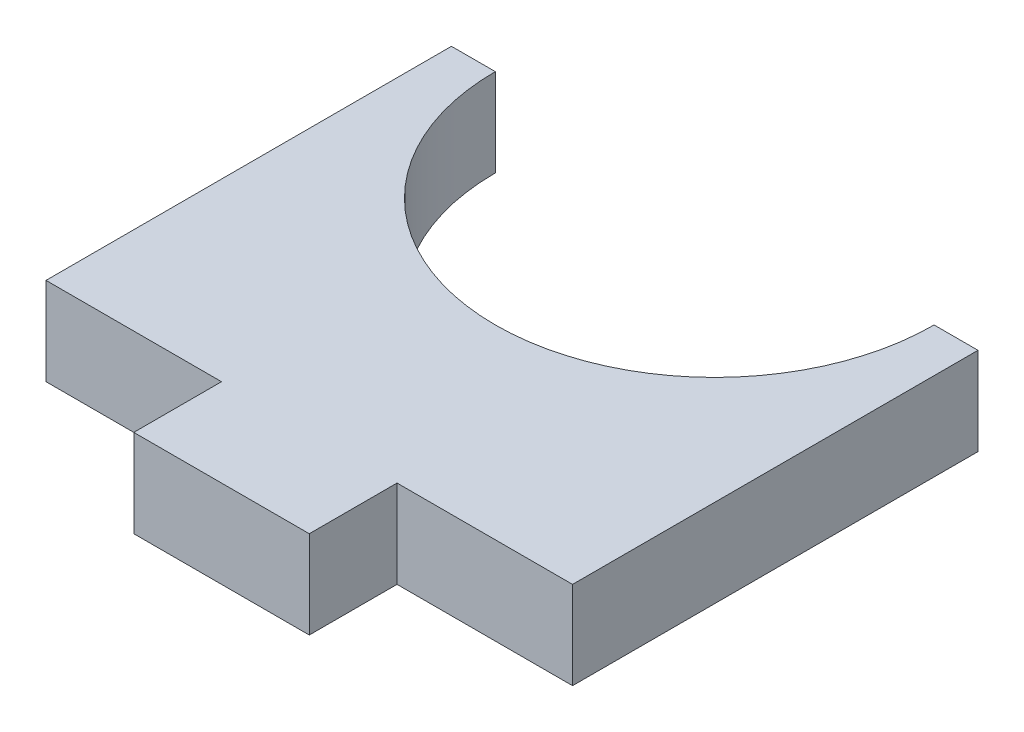
ISO-10303-21;
HEADER;
FILE_DESCRIPTION(('STEP AP214'),'2;1');
FILE_NAME('part.step','',(''),(''),'','','');
FILE_SCHEMA(('AUTOMOTIVE_DESIGN { 1 0 10303 214 1 1 1 1 }'));
ENDSEC;
DATA;
#1=APPLICATION_CONTEXT('core data for automotive mechanical design processes');
#2=APPLICATION_PROTOCOL_DEFINITION('international standard','automotive_design',2000,#1);
#3=PRODUCT_CONTEXT('',#1,'mechanical');
#4=PRODUCT('Part','Part','',(#3));
#5=PRODUCT_RELATED_PRODUCT_CATEGORY('part','',(#4));
#6=PRODUCT_DEFINITION_FORMATION('','',#4);
#7=PRODUCT_DEFINITION_CONTEXT('part definition',#1,'design');
#8=PRODUCT_DEFINITION('design','',#6,#7);
#9=PRODUCT_DEFINITION_SHAPE('','',#8);
#10=(LENGTH_UNIT() NAMED_UNIT(*) SI_UNIT(.MILLI.,.METRE.));
#11=(NAMED_UNIT(*) PLANE_ANGLE_UNIT() SI_UNIT($,.RADIAN.));
#12=(NAMED_UNIT(*) SI_UNIT($,.STERADIAN.) SOLID_ANGLE_UNIT());
#13=UNCERTAINTY_MEASURE_WITH_UNIT(LENGTH_MEASURE(1.E-05),#10,'distance_accuracy_value','');
#14=(GEOMETRIC_REPRESENTATION_CONTEXT(3) GLOBAL_UNCERTAINTY_ASSIGNED_CONTEXT((#13)) GLOBAL_UNIT_ASSIGNED_CONTEXT((#10,
#11,#12)) REPRESENTATION_CONTEXT('',''));
#15=CARTESIAN_POINT('',(0.,0.,0.));
#16=DIRECTION('',(0.,0.,1.));
#17=DIRECTION('',(1.,0.,0.));
#18=AXIS2_PLACEMENT_3D('',#15,#16,#17);
#19=CARTESIAN_POINT('',(0.,5.,11.55));
#20=DIRECTION('',(0.,0.,-1.));
#21=DIRECTION('',(-1.,0.,0.));
#22=AXIS2_PLACEMENT_3D('',#19,#20,#21);
#23=PLANE('',#22);
#24=DIRECTION('',(0.,1.,0.));
#25=VECTOR('',#24,1.);
#26=CARTESIAN_POINT('',(5.,0.,11.55));
#27=LINE('',#26,#25);
#28=CARTESIAN_POINT('',(5.,0.,11.55));
#29=VERTEX_POINT('',#28);
#30=CARTESIAN_POINT('',(5.,5.,11.55));
#31=VERTEX_POINT('',#30);
#32=EDGE_CURVE('E140',#29,#31,#27,.T.);
#33=ORIENTED_EDGE('',*,*,#32,.F.);
#34=DIRECTION('',(1.,0.,0.));
#35=VECTOR('',#34,1.);
#36=CARTESIAN_POINT('',(0.,0.,11.55));
#37=LINE('',#36,#35);
#38=CARTESIAN_POINT('',(15.,0.,11.55));
#39=VERTEX_POINT('',#38);
#40=EDGE_CURVE('E116',#29,#39,#37,.T.);
#41=ORIENTED_EDGE('',*,*,#40,.T.);
#42=DIRECTION('',(0.,-1.,0.));
#43=VECTOR('',#42,1.);
#44=CARTESIAN_POINT('',(15.,5.,11.55));
#45=LINE('',#44,#43);
#46=CARTESIAN_POINT('',(15.,5.,11.55));
#47=VERTEX_POINT('',#46);
#48=EDGE_CURVE('E95',#47,#39,#45,.T.);
#49=ORIENTED_EDGE('',*,*,#48,.F.);
#50=DIRECTION('',(1.,0.,0.));
#51=VECTOR('',#50,1.);
#52=CARTESIAN_POINT('',(0.,5.,11.55));
#53=LINE('',#52,#51);
#54=EDGE_CURVE('E64',#31,#47,#53,.T.);
#55=ORIENTED_EDGE('',*,*,#54,.F.);
#56=EDGE_LOOP('',(#33,#41,#49,#55));
#57=FACE_BOUND('',#56,.T.);
#58=ADVANCED_FACE('F40',(#57),#23,.F.);
#59=CARTESIAN_POINT('',(-15.,5.,0.));
#60=DIRECTION('',(-1.,0.,0.));
#61=DIRECTION('',(0.,0.,1.));
#62=AXIS2_PLACEMENT_3D('',#59,#60,#61);
#63=PLANE('',#62);
#64=DIRECTION('',(0.,0.,-1.));
#65=VECTOR('',#64,1.);
#66=CARTESIAN_POINT('',(-15.,0.,0.));
#67=LINE('',#66,#65);
#68=CARTESIAN_POINT('',(-15.,0.,11.55));
#69=VERTEX_POINT('',#68);
#70=CARTESIAN_POINT('',(-15.,0.,-11.55));
#71=VERTEX_POINT('',#70);
#72=EDGE_CURVE('E128',#69,#71,#67,.T.);
#73=ORIENTED_EDGE('',*,*,#72,.F.);
#74=DIRECTION('',(0.,-1.,0.));
#75=VECTOR('',#74,1.);
#76=CARTESIAN_POINT('',(-15.,5.,11.55));
#77=LINE('',#76,#75);
#78=CARTESIAN_POINT('',(-15.,5.,11.55));
#79=VERTEX_POINT('',#78);
#80=EDGE_CURVE('E121',#79,#69,#77,.T.);
#81=ORIENTED_EDGE('',*,*,#80,.F.);
#82=DIRECTION('',(0.,0.,-1.));
#83=VECTOR('',#82,1.);
#84=CARTESIAN_POINT('',(-15.,5.,0.));
#85=LINE('',#84,#83);
#86=CARTESIAN_POINT('',(-15.,5.,-11.55));
#87=VERTEX_POINT('',#86);
#88=EDGE_CURVE('E110',#79,#87,#85,.T.);
#89=ORIENTED_EDGE('',*,*,#88,.T.);
#90=DIRECTION('',(0.,-1.,0.));
#91=VECTOR('',#90,1.);
#92=CARTESIAN_POINT('',(-15.,5.,-11.55));
#93=LINE('',#92,#91);
#94=EDGE_CURVE('E106',#87,#71,#93,.T.);
#95=ORIENTED_EDGE('',*,*,#94,.T.);
#96=EDGE_LOOP('',(#73,#81,#89,#95));
#97=FACE_BOUND('',#96,.T.);
#98=ADVANCED_FACE('F42',(#97),#63,.T.);
#99=CARTESIAN_POINT('',(-5.,0.,11.55));
#100=VERTEX_POINT('',#99);
#101=EDGE_CURVE('E111',#69,#100,#37,.T.);
#102=ORIENTED_EDGE('',*,*,#101,.T.);
#103=DIRECTION('',(0.,1.,0.));
#104=VECTOR('',#103,1.);
#105=CARTESIAN_POINT('',(-5.,0.,11.55));
#106=LINE('',#105,#104);
#107=CARTESIAN_POINT('',(-5.,5.,11.55));
#108=VERTEX_POINT('',#107);
#109=EDGE_CURVE('E139',#100,#108,#106,.T.);
#110=ORIENTED_EDGE('',*,*,#109,.T.);
#111=EDGE_CURVE('E144',#79,#108,#53,.T.);
#112=ORIENTED_EDGE('',*,*,#111,.F.);
#113=ORIENTED_EDGE('',*,*,#80,.T.);
#114=EDGE_LOOP('',(#102,#110,#112,#113));
#115=FACE_BOUND('',#114,.T.);
#116=ADVANCED_FACE('F218',(#115),#23,.F.);
#117=CARTESIAN_POINT('',(15.,5.,0.));
#118=DIRECTION('',(-1.,0.,0.));
#119=DIRECTION('',(0.,0.,1.));
#120=AXIS2_PLACEMENT_3D('',#117,#118,#119);
#121=PLANE('',#120);
#122=DIRECTION('',(0.,0.,-1.));
#123=VECTOR('',#122,1.);
#124=CARTESIAN_POINT('',(15.,0.,0.));
#125=LINE('',#124,#123);
#126=CARTESIAN_POINT('',(15.,0.,-11.55));
#127=VERTEX_POINT('',#126);
#128=EDGE_CURVE('E104',#39,#127,#125,.T.);
#129=ORIENTED_EDGE('',*,*,#128,.T.);
#130=DIRECTION('',(0.,-1.,0.));
#131=VECTOR('',#130,1.);
#132=CARTESIAN_POINT('',(15.,5.,-11.55));
#133=LINE('',#132,#131);
#134=CARTESIAN_POINT('',(15.,5.,-11.55));
#135=VERTEX_POINT('',#134);
#136=EDGE_CURVE('E82',#135,#127,#133,.T.);
#137=ORIENTED_EDGE('',*,*,#136,.F.);
#138=DIRECTION('',(0.,0.,-1.));
#139=VECTOR('',#138,1.);
#140=CARTESIAN_POINT('',(15.,5.,0.));
#141=LINE('',#140,#139);
#142=EDGE_CURVE('E96',#47,#135,#141,.T.);
#143=ORIENTED_EDGE('',*,*,#142,.F.);
#144=ORIENTED_EDGE('',*,*,#48,.T.);
#145=EDGE_LOOP('',(#129,#137,#143,#144));
#146=FACE_BOUND('',#145,.T.);
#147=ADVANCED_FACE('F109',(#146),#121,.F.);
#148=CARTESIAN_POINT('',(0.,5.,0.));
#149=DIRECTION('',(0.,1.,0.));
#150=DIRECTION('',(0.,0.,1.));
#151=AXIS2_PLACEMENT_3D('',#148,#149,#150);
#152=PLANE('',#151);
#153=DIRECTION('',(1.,0.,0.));
#154=VECTOR('',#153,1.);
#155=CARTESIAN_POINT('',(0.,5.,-11.55));
#156=LINE('',#155,#154);
#157=CARTESIAN_POINT('',(-12.5,5.,-11.55));
#158=VERTEX_POINT('',#157);
#159=EDGE_CURVE('E172',#87,#158,#156,.T.);
#160=ORIENTED_EDGE('',*,*,#159,.F.);
#161=ORIENTED_EDGE('',*,*,#88,.F.);
#162=ORIENTED_EDGE('',*,*,#111,.T.);
#163=DIRECTION('',(0.,0.,1.));
#164=VECTOR('',#163,1.);
#165=CARTESIAN_POINT('',(-5.,5.,11.55));
#166=LINE('',#165,#164);
#167=CARTESIAN_POINT('',(-5.,5.,16.55));
#168=VERTEX_POINT('',#167);
#169=EDGE_CURVE('E55',#108,#168,#166,.T.);
#170=ORIENTED_EDGE('',*,*,#169,.T.);
#171=DIRECTION('',(1.,0.,0.));
#172=VECTOR('',#171,1.);
#173=CARTESIAN_POINT('',(-5.,5.,16.55));
#174=LINE('',#173,#172);
#175=CARTESIAN_POINT('',(5.,5.,16.55));
#176=VERTEX_POINT('',#175);
#177=EDGE_CURVE('E158',#168,#176,#174,.T.);
#178=ORIENTED_EDGE('',*,*,#177,.T.);
#179=DIRECTION('',(0.,0.,-1.));
#180=VECTOR('',#179,1.);
#181=CARTESIAN_POINT('',(5.,5.,11.55));
#182=LINE('',#181,#180);
#183=EDGE_CURVE('E155',#176,#31,#182,.T.);
#184=ORIENTED_EDGE('',*,*,#183,.T.);
#185=ORIENTED_EDGE('',*,*,#54,.T.);
#186=ORIENTED_EDGE('',*,*,#142,.T.);
#187=DIRECTION('',(1.,0.,0.));
#188=VECTOR('',#187,1.);
#189=CARTESIAN_POINT('',(0.,5.,-11.55));
#190=LINE('',#189,#188);
#191=CARTESIAN_POINT('',(12.5,5.,-11.55));
#192=VERTEX_POINT('',#191);
#193=EDGE_CURVE('E91',#192,#135,#190,.T.);
#194=ORIENTED_EDGE('',*,*,#193,.F.);
#195=CARTESIAN_POINT('',(0.,5.,-11.55));
#196=DIRECTION('',(0.,1.,0.));
#197=DIRECTION('',(0.,0.,1.));
#198=AXIS2_PLACEMENT_3D('',#195,#196,#197);
#199=CIRCLE('',#198,12.5);
#200=EDGE_CURVE('E177',#158,#192,#199,.T.);
#201=ORIENTED_EDGE('',*,*,#200,.F.);
#202=EDGE_LOOP('',(#160,#161,#162,#170,#178,#184,#185,#186,#194,#201));
#203=FACE_BOUND('',#202,.T.);
#204=ADVANCED_FACE('F186',(#203),#152,.T.);
#205=CARTESIAN_POINT('',(0.,0.,0.));
#206=DIRECTION('',(0.,1.,0.));
#207=DIRECTION('',(0.,0.,1.));
#208=AXIS2_PLACEMENT_3D('',#205,#206,#207);
#209=PLANE('',#208);
#210=ORIENTED_EDGE('',*,*,#72,.T.);
#211=DIRECTION('',(1.,0.,0.));
#212=VECTOR('',#211,1.);
#213=CARTESIAN_POINT('',(0.,0.,-11.55));
#214=LINE('',#213,#212);
#215=CARTESIAN_POINT('',(-12.5,0.,-11.55));
#216=VERTEX_POINT('',#215);
#217=EDGE_CURVE('E11',#71,#216,#214,.T.);
#218=ORIENTED_EDGE('',*,*,#217,.T.);
#219=CARTESIAN_POINT('',(0.,0.,-11.55));
#220=DIRECTION('',(0.,1.,0.));
#221=DIRECTION('',(0.,0.,1.));
#222=AXIS2_PLACEMENT_3D('',#219,#220,#221);
#223=CIRCLE('',#222,12.5);
#224=CARTESIAN_POINT('',(12.5,0.,-11.55));
#225=VERTEX_POINT('',#224);
#226=EDGE_CURVE('E48',#216,#225,#223,.T.);
#227=ORIENTED_EDGE('',*,*,#226,.T.);
#228=DIRECTION('',(1.,0.,0.));
#229=VECTOR('',#228,1.);
#230=CARTESIAN_POINT('',(0.,0.,-11.55));
#231=LINE('',#230,#229);
#232=EDGE_CURVE('E87',#225,#127,#231,.T.);
#233=ORIENTED_EDGE('',*,*,#232,.T.);
#234=ORIENTED_EDGE('',*,*,#128,.F.);
#235=ORIENTED_EDGE('',*,*,#40,.F.);
#236=DIRECTION('',(0.,0.,-1.));
#237=VECTOR('',#236,1.);
#238=CARTESIAN_POINT('',(5.,0.,11.55));
#239=LINE('',#238,#237);
#240=CARTESIAN_POINT('',(5.,0.,16.55));
#241=VERTEX_POINT('',#240);
#242=EDGE_CURVE('E150',#241,#29,#239,.T.);
#243=ORIENTED_EDGE('',*,*,#242,.F.);
#244=DIRECTION('',(1.,0.,0.));
#245=VECTOR('',#244,1.);
#246=CARTESIAN_POINT('',(-5.,0.,16.55));
#247=LINE('',#246,#245);
#248=CARTESIAN_POINT('',(-5.,0.,16.55));
#249=VERTEX_POINT('',#248);
#250=EDGE_CURVE('E165',#249,#241,#247,.T.);
#251=ORIENTED_EDGE('',*,*,#250,.F.);
#252=DIRECTION('',(0.,0.,1.));
#253=VECTOR('',#252,1.);
#254=CARTESIAN_POINT('',(-5.,0.,11.55));
#255=LINE('',#254,#253);
#256=EDGE_CURVE('E157',#100,#249,#255,.T.);
#257=ORIENTED_EDGE('',*,*,#256,.F.);
#258=ORIENTED_EDGE('',*,*,#101,.F.);
#259=EDGE_LOOP('',(#210,#218,#227,#233,#234,#235,#243,#251,#257,#258));
#260=FACE_BOUND('',#259,.T.);
#261=ADVANCED_FACE('F102',(#260),#209,.F.);
#262=CARTESIAN_POINT('',(-5.,0.,11.55));
#263=DIRECTION('',(-1.,0.,0.));
#264=DIRECTION('',(0.,0.,1.));
#265=AXIS2_PLACEMENT_3D('',#262,#263,#264);
#266=PLANE('',#265);
#267=ORIENTED_EDGE('',*,*,#169,.F.);
#268=ORIENTED_EDGE('',*,*,#109,.F.);
#269=ORIENTED_EDGE('',*,*,#256,.T.);
#270=DIRECTION('',(0.,1.,0.));
#271=VECTOR('',#270,1.);
#272=CARTESIAN_POINT('',(-5.,0.,16.55));
#273=LINE('',#272,#271);
#274=EDGE_CURVE('E147',#249,#168,#273,.T.);
#275=ORIENTED_EDGE('',*,*,#274,.T.);
#276=EDGE_LOOP('',(#267,#268,#269,#275));
#277=FACE_BOUND('',#276,.T.);
#278=ADVANCED_FACE('F216',(#277),#266,.T.);
#279=CARTESIAN_POINT('',(5.,0.,11.55));
#280=DIRECTION('',(1.,0.,0.));
#281=DIRECTION('',(0.,0.,-1.));
#282=AXIS2_PLACEMENT_3D('',#279,#280,#281);
#283=PLANE('',#282);
#284=ORIENTED_EDGE('',*,*,#183,.F.);
#285=DIRECTION('',(0.,1.,0.));
#286=VECTOR('',#285,1.);
#287=CARTESIAN_POINT('',(5.,0.,16.55));
#288=LINE('',#287,#286);
#289=EDGE_CURVE('E149',#241,#176,#288,.T.);
#290=ORIENTED_EDGE('',*,*,#289,.F.);
#291=ORIENTED_EDGE('',*,*,#242,.T.);
#292=ORIENTED_EDGE('',*,*,#32,.T.);
#293=EDGE_LOOP('',(#284,#290,#291,#292));
#294=FACE_BOUND('',#293,.T.);
#295=ADVANCED_FACE('F209',(#294),#283,.T.);
#296=CARTESIAN_POINT('',(-5.,0.,16.55));
#297=DIRECTION('',(0.,0.,1.));
#298=DIRECTION('',(1.,0.,0.));
#299=AXIS2_PLACEMENT_3D('',#296,#297,#298);
#300=PLANE('',#299);
#301=ORIENTED_EDGE('',*,*,#177,.F.);
#302=ORIENTED_EDGE('',*,*,#274,.F.);
#303=ORIENTED_EDGE('',*,*,#250,.T.);
#304=ORIENTED_EDGE('',*,*,#289,.T.);
#305=EDGE_LOOP('',(#301,#302,#303,#304));
#306=FACE_BOUND('',#305,.T.);
#307=ADVANCED_FACE('F215',(#306),#300,.T.);
#308=CARTESIAN_POINT('',(0.,-5.,-11.55));
#309=DIRECTION('',(0.,1.,0.));
#310=DIRECTION('',(0.,0.,1.));
#311=AXIS2_PLACEMENT_3D('',#308,#309,#310);
#312=CYLINDRICAL_SURFACE('',#311,12.5);
#313=DIRECTION('',(0.,1.,0.));
#314=VECTOR('',#313,1.);
#315=CARTESIAN_POINT('',(-12.5,-5.,-11.55));
#316=LINE('',#315,#314);
#317=EDGE_CURVE('E162',#216,#158,#316,.T.);
#318=ORIENTED_EDGE('',*,*,#317,.T.);
#319=ORIENTED_EDGE('',*,*,#200,.T.);
#320=DIRECTION('',(0.,1.,0.));
#321=VECTOR('',#320,1.);
#322=CARTESIAN_POINT('',(12.5,-5.,-11.55));
#323=LINE('',#322,#321);
#324=EDGE_CURVE('E170',#225,#192,#323,.T.);
#325=ORIENTED_EDGE('',*,*,#324,.F.);
#326=ORIENTED_EDGE('',*,*,#226,.F.);
#327=EDGE_LOOP('',(#318,#319,#325,#326));
#328=FACE_BOUND('',#327,.T.);
#329=ADVANCED_FACE('F182',(#328),#312,.F.);
#330=CARTESIAN_POINT('',(0.,-5.,-11.55));
#331=DIRECTION('',(0.,0.,1.));
#332=DIRECTION('',(1.,0.,0.));
#333=AXIS2_PLACEMENT_3D('',#330,#331,#332);
#334=PLANE('',#333);
#335=ORIENTED_EDGE('',*,*,#94,.F.);
#336=ORIENTED_EDGE('',*,*,#159,.T.);
#337=ORIENTED_EDGE('',*,*,#317,.F.);
#338=ORIENTED_EDGE('',*,*,#217,.F.);
#339=EDGE_LOOP('',(#335,#336,#337,#338));
#340=FACE_BOUND('',#339,.T.);
#341=ADVANCED_FACE('F220',(#340),#334,.F.);
#342=CARTESIAN_POINT('',(0.,-5.,-11.55));
#343=DIRECTION('',(0.,0.,1.));
#344=DIRECTION('',(1.,0.,0.));
#345=AXIS2_PLACEMENT_3D('',#342,#343,#344);
#346=PLANE('',#345);
#347=ORIENTED_EDGE('',*,*,#324,.T.);
#348=ORIENTED_EDGE('',*,*,#193,.T.);
#349=ORIENTED_EDGE('',*,*,#136,.T.);
#350=ORIENTED_EDGE('',*,*,#232,.F.);
#351=EDGE_LOOP('',(#347,#348,#349,#350));
#352=FACE_BOUND('',#351,.T.);
#353=ADVANCED_FACE('F85',(#352),#346,.F.);
#354=CLOSED_SHELL('',(#58,#98,#116,#147,#204,#261,#278,#295,#307,#329,#341,#353));
#355=MANIFOLD_SOLID_BREP('B2',#354);
#356=ADVANCED_BREP_SHAPE_REPRESENTATION('',(#18,#355),#14);
#357=SHAPE_DEFINITION_REPRESENTATION(#9,#356);
ENDSEC;
END-ISO-10303-21;
